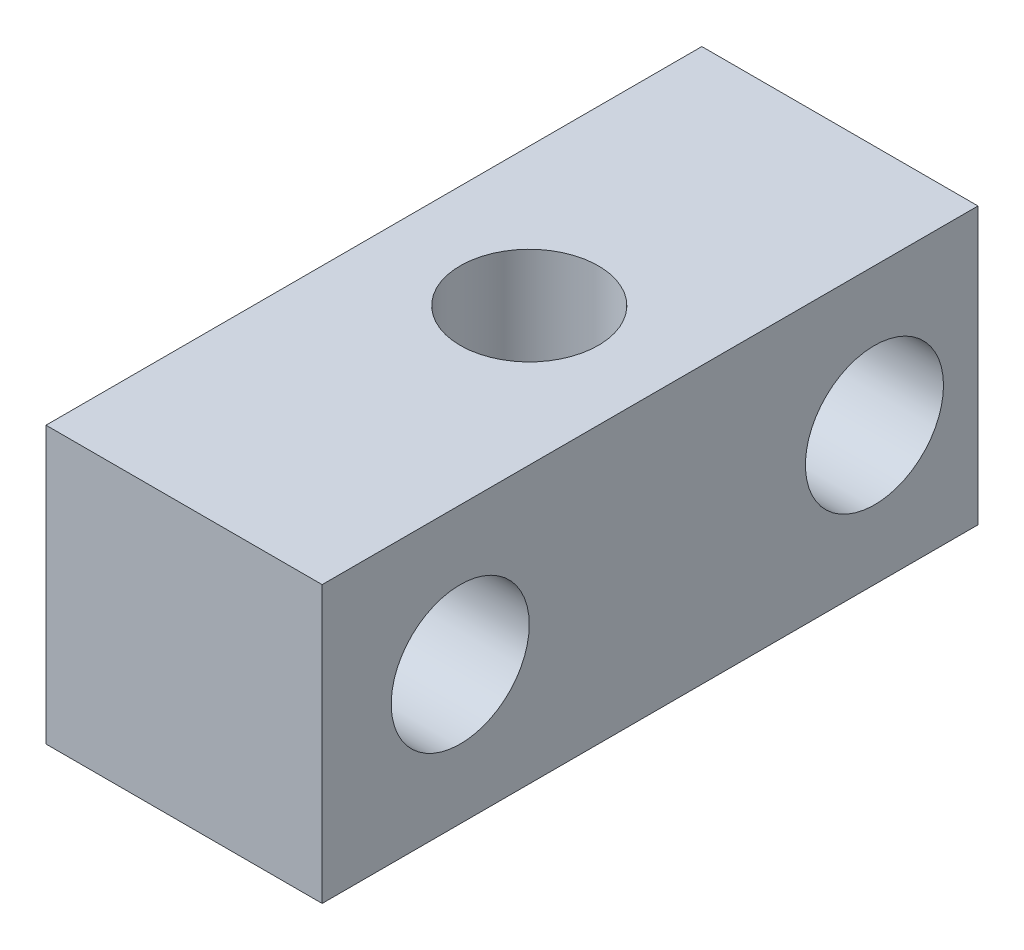
ISO-10303-21;
HEADER;
FILE_DESCRIPTION(('STEP AP214'),'2;1');
FILE_NAME('part.step','',(''),(''),'','','');
FILE_SCHEMA(('AUTOMOTIVE_DESIGN { 1 0 10303 214 1 1 1 1 }'));
ENDSEC;
DATA;
#1=APPLICATION_CONTEXT('core data for automotive mechanical design processes');
#2=APPLICATION_PROTOCOL_DEFINITION('international standard','automotive_design',2000,#1);
#3=PRODUCT_CONTEXT('',#1,'mechanical');
#4=PRODUCT('Part','Part','',(#3));
#5=PRODUCT_RELATED_PRODUCT_CATEGORY('part','',(#4));
#6=PRODUCT_DEFINITION_FORMATION('','',#4);
#7=PRODUCT_DEFINITION_CONTEXT('part definition',#1,'design');
#8=PRODUCT_DEFINITION('design','',#6,#7);
#9=PRODUCT_DEFINITION_SHAPE('','',#8);
#10=(LENGTH_UNIT() NAMED_UNIT(*) SI_UNIT(.MILLI.,.METRE.));
#11=(NAMED_UNIT(*) PLANE_ANGLE_UNIT() SI_UNIT($,.RADIAN.));
#12=(NAMED_UNIT(*) SI_UNIT($,.STERADIAN.) SOLID_ANGLE_UNIT());
#13=UNCERTAINTY_MEASURE_WITH_UNIT(LENGTH_MEASURE(1.E-05),#10,'distance_accuracy_value','');
#14=(GEOMETRIC_REPRESENTATION_CONTEXT(3) GLOBAL_UNCERTAINTY_ASSIGNED_CONTEXT((#13)) GLOBAL_UNIT_ASSIGNED_CONTEXT((#10,
#11,#12)) REPRESENTATION_CONTEXT('',''));
#15=CARTESIAN_POINT('',(0.,0.,0.));
#16=DIRECTION('',(0.,0.,1.));
#17=DIRECTION('',(1.,0.,0.));
#18=AXIS2_PLACEMENT_3D('',#15,#16,#17);
#19=CARTESIAN_POINT('',(-6.35,6.35,34.925));
#20=DIRECTION('',(0.,-1.,0.));
#21=DIRECTION('',(0.,0.,-1.));
#22=AXIS2_PLACEMENT_3D('',#19,#20,#21);
#23=PLANE('',#22);
#24=DIRECTION('',(0.,0.,-1.));
#25=VECTOR('',#24,1.);
#26=CARTESIAN_POINT('',(6.35,6.35,34.925));
#27=LINE('',#26,#25);
#28=CARTESIAN_POINT('',(6.35,6.35,34.925));
#29=VERTEX_POINT('',#28);
#30=CARTESIAN_POINT('',(6.35,6.35,4.7625));
#31=VERTEX_POINT('',#30);
#32=EDGE_CURVE('E104',#29,#31,#27,.T.);
#33=ORIENTED_EDGE('',*,*,#32,.T.);
#34=DIRECTION('',(1.,0.,0.));
#35=VECTOR('',#34,1.);
#36=CARTESIAN_POINT('',(0.,6.35,4.7625));
#37=LINE('',#36,#35);
#38=CARTESIAN_POINT('',(-6.35,6.35,4.7625));
#39=VERTEX_POINT('',#38);
#40=EDGE_CURVE('E47',#39,#31,#37,.T.);
#41=ORIENTED_EDGE('',*,*,#40,.F.);
#42=DIRECTION('',(0.,0.,-1.));
#43=VECTOR('',#42,1.);
#44=CARTESIAN_POINT('',(-6.35,6.35,34.925));
#45=LINE('',#44,#43);
#46=CARTESIAN_POINT('',(-6.35,6.35,34.925));
#47=VERTEX_POINT('',#46);
#48=EDGE_CURVE('E85',#47,#39,#45,.T.);
#49=ORIENTED_EDGE('',*,*,#48,.F.);
#50=DIRECTION('',(-1.,0.,0.));
#51=VECTOR('',#50,1.);
#52=CARTESIAN_POINT('',(-6.35,6.35,34.925));
#53=LINE('',#52,#51);
#54=EDGE_CURVE('E55',#29,#47,#53,.T.);
#55=ORIENTED_EDGE('',*,*,#54,.F.);
#56=EDGE_LOOP('',(#33,#41,#49,#55));
#57=FACE_BOUND('',#56,.T.);
#58=CARTESIAN_POINT('',(0.,6.35,19.05));
#59=DIRECTION('',(0.,1.,0.));
#60=DIRECTION('',(0.,0.,1.));
#61=AXIS2_PLACEMENT_3D('',#58,#59,#60);
#62=CIRCLE('',#61,3.17499999999999);
#63=CARTESIAN_POINT('',(0.,6.35,22.225));
#64=VERTEX_POINT('',#63);
#65=EDGE_CURVE('E97',#64,#64,#62,.T.);
#66=ORIENTED_EDGE('',*,*,#65,.F.);
#67=EDGE_LOOP('',(#66));
#68=FACE_BOUND('',#67,.T.);
#69=ADVANCED_FACE('F32',(#57,#68),#23,.F.);
#70=CARTESIAN_POINT('',(-6.35,-6.35,34.925));
#71=DIRECTION('',(1.,0.,0.));
#72=DIRECTION('',(0.,0.,-1.));
#73=AXIS2_PLACEMENT_3D('',#70,#71,#72);
#74=PLANE('',#73);
#75=CARTESIAN_POINT('',(-6.35,0.,9.525));
#76=DIRECTION('',(1.,0.,0.));
#77=DIRECTION('',(0.,0.,-1.));
#78=AXIS2_PLACEMENT_3D('',#75,#76,#77);
#79=CIRCLE('',#78,3.175);
#80=CARTESIAN_POINT('',(-6.35,0.,6.35000000000001));
#81=VERTEX_POINT('',#80);
#82=EDGE_CURVE('E117',#81,#81,#79,.T.);
#83=ORIENTED_EDGE('',*,*,#82,.T.);
#84=EDGE_LOOP('',(#83));
#85=FACE_BOUND('',#84,.T.);
#86=CARTESIAN_POINT('',(-6.35,0.,28.575));
#87=DIRECTION('',(1.,0.,0.));
#88=DIRECTION('',(0.,0.,-1.));
#89=AXIS2_PLACEMENT_3D('',#86,#87,#88);
#90=CIRCLE('',#89,3.175);
#91=CARTESIAN_POINT('',(-6.35,0.,25.4));
#92=VERTEX_POINT('',#91);
#93=EDGE_CURVE('E123',#92,#92,#90,.T.);
#94=ORIENTED_EDGE('',*,*,#93,.T.);
#95=EDGE_LOOP('',(#94));
#96=FACE_BOUND('',#95,.T.);
#97=ORIENTED_EDGE('',*,*,#48,.T.);
#98=DIRECTION('',(0.,1.,0.));
#99=VECTOR('',#98,1.);
#100=CARTESIAN_POINT('',(-6.35,-6.35,4.7625));
#101=LINE('',#100,#99);
#102=CARTESIAN_POINT('',(-6.35,-6.35,4.7625));
#103=VERTEX_POINT('',#102);
#104=EDGE_CURVE('E75',#103,#39,#101,.T.);
#105=ORIENTED_EDGE('',*,*,#104,.F.);
#106=DIRECTION('',(0.,0.,-1.));
#107=VECTOR('',#106,1.);
#108=CARTESIAN_POINT('',(-6.35,-6.35,34.925));
#109=LINE('',#108,#107);
#110=CARTESIAN_POINT('',(-6.35,-6.35,34.925));
#111=VERTEX_POINT('',#110);
#112=EDGE_CURVE('E11',#111,#103,#109,.T.);
#113=ORIENTED_EDGE('',*,*,#112,.F.);
#114=DIRECTION('',(0.,-1.,0.));
#115=VECTOR('',#114,1.);
#116=CARTESIAN_POINT('',(-6.35,-6.35,34.925));
#117=LINE('',#116,#115);
#118=EDGE_CURVE('E91',#47,#111,#117,.T.);
#119=ORIENTED_EDGE('',*,*,#118,.F.);
#120=EDGE_LOOP('',(#97,#105,#113,#119));
#121=FACE_BOUND('',#120,.T.);
#122=ADVANCED_FACE('F34',(#85,#96,#121),#74,.F.);
#123=CARTESIAN_POINT('',(-6.35,-6.35,34.925));
#124=DIRECTION('',(0.,1.,0.));
#125=DIRECTION('',(0.,0.,1.));
#126=AXIS2_PLACEMENT_3D('',#123,#124,#125);
#127=PLANE('',#126);
#128=CARTESIAN_POINT('',(0.,-6.35,19.05));
#129=DIRECTION('',(0.,1.,0.));
#130=DIRECTION('',(0.,0.,1.));
#131=AXIS2_PLACEMENT_3D('',#128,#129,#130);
#132=CIRCLE('',#131,3.175);
#133=CARTESIAN_POINT('',(0.,-6.35,22.225));
#134=VERTEX_POINT('',#133);
#135=EDGE_CURVE('E94',#134,#134,#132,.T.);
#136=ORIENTED_EDGE('',*,*,#135,.T.);
#137=EDGE_LOOP('',(#136));
#138=FACE_BOUND('',#137,.T.);
#139=ORIENTED_EDGE('',*,*,#112,.T.);
#140=DIRECTION('',(1.,0.,0.));
#141=VECTOR('',#140,1.);
#142=CARTESIAN_POINT('',(0.,-6.35,4.7625));
#143=LINE('',#142,#141);
#144=CARTESIAN_POINT('',(6.35,-6.35,4.7625));
#145=VERTEX_POINT('',#144);
#146=EDGE_CURVE('E72',#103,#145,#143,.T.);
#147=ORIENTED_EDGE('',*,*,#146,.T.);
#148=DIRECTION('',(0.,0.,-1.));
#149=VECTOR('',#148,1.);
#150=CARTESIAN_POINT('',(6.35,-6.35,34.925));
#151=LINE('',#150,#149);
#152=CARTESIAN_POINT('',(6.35,-6.35,34.925));
#153=VERTEX_POINT('',#152);
#154=EDGE_CURVE('E40',#153,#145,#151,.T.);
#155=ORIENTED_EDGE('',*,*,#154,.F.);
#156=DIRECTION('',(1.,0.,0.));
#157=VECTOR('',#156,1.);
#158=CARTESIAN_POINT('',(-6.35,-6.35,34.925));
#159=LINE('',#158,#157);
#160=EDGE_CURVE('E88',#111,#153,#159,.T.);
#161=ORIENTED_EDGE('',*,*,#160,.F.);
#162=EDGE_LOOP('',(#139,#147,#155,#161));
#163=FACE_BOUND('',#162,.T.);
#164=ADVANCED_FACE('F87',(#138,#163),#127,.F.);
#165=CARTESIAN_POINT('',(6.35,-6.35,34.925));
#166=DIRECTION('',(-1.,0.,0.));
#167=DIRECTION('',(0.,0.,1.));
#168=AXIS2_PLACEMENT_3D('',#165,#166,#167);
#169=PLANE('',#168);
#170=CARTESIAN_POINT('',(6.35,0.,9.525));
#171=DIRECTION('',(1.,0.,0.));
#172=DIRECTION('',(0.,0.,-1.));
#173=AXIS2_PLACEMENT_3D('',#170,#171,#172);
#174=CIRCLE('',#173,3.17499999999999);
#175=CARTESIAN_POINT('',(6.35,0.,6.35000000000002));
#176=VERTEX_POINT('',#175);
#177=EDGE_CURVE('E113',#176,#176,#174,.T.);
#178=ORIENTED_EDGE('',*,*,#177,.F.);
#179=EDGE_LOOP('',(#178));
#180=FACE_BOUND('',#179,.T.);
#181=CARTESIAN_POINT('',(6.35,0.,28.575));
#182=DIRECTION('',(1.,0.,0.));
#183=DIRECTION('',(0.,0.,-1.));
#184=AXIS2_PLACEMENT_3D('',#181,#182,#183);
#185=CIRCLE('',#184,3.17499999999999);
#186=CARTESIAN_POINT('',(6.35,0.,25.4));
#187=VERTEX_POINT('',#186);
#188=EDGE_CURVE('E120',#187,#187,#185,.T.);
#189=ORIENTED_EDGE('',*,*,#188,.F.);
#190=EDGE_LOOP('',(#189));
#191=FACE_BOUND('',#190,.T.);
#192=ORIENTED_EDGE('',*,*,#154,.T.);
#193=DIRECTION('',(0.,1.,0.));
#194=VECTOR('',#193,1.);
#195=CARTESIAN_POINT('',(6.35,-6.35,4.7625));
#196=LINE('',#195,#194);
#197=EDGE_CURVE('E76',#145,#31,#196,.T.);
#198=ORIENTED_EDGE('',*,*,#197,.T.);
#199=ORIENTED_EDGE('',*,*,#32,.F.);
#200=DIRECTION('',(0.,1.,0.));
#201=VECTOR('',#200,1.);
#202=CARTESIAN_POINT('',(6.35,-6.35,34.925));
#203=LINE('',#202,#201);
#204=EDGE_CURVE('E90',#153,#29,#203,.T.);
#205=ORIENTED_EDGE('',*,*,#204,.F.);
#206=EDGE_LOOP('',(#192,#198,#199,#205));
#207=FACE_BOUND('',#206,.T.);
#208=ADVANCED_FACE('F107',(#180,#191,#207),#169,.F.);
#209=CARTESIAN_POINT('',(0.,0.,34.925));
#210=DIRECTION('',(0.,0.,-1.));
#211=DIRECTION('',(-1.,0.,0.));
#212=AXIS2_PLACEMENT_3D('',#209,#210,#211);
#213=PLANE('',#212);
#214=ORIENTED_EDGE('',*,*,#118,.T.);
#215=ORIENTED_EDGE('',*,*,#160,.T.);
#216=ORIENTED_EDGE('',*,*,#204,.T.);
#217=ORIENTED_EDGE('',*,*,#54,.T.);
#218=EDGE_LOOP('',(#214,#215,#216,#217));
#219=FACE_BOUND('',#218,.T.);
#220=ADVANCED_FACE('F93',(#219),#213,.F.);
#221=CARTESIAN_POINT('',(0.,6.35,19.05));
#222=DIRECTION('',(0.,1.,0.));
#223=DIRECTION('',(0.,0.,1.));
#224=AXIS2_PLACEMENT_3D('',#221,#222,#223);
#225=CYLINDRICAL_SURFACE('',#224,3.17499999999999);
#226=ORIENTED_EDGE('',*,*,#135,.F.);
#227=EDGE_LOOP('',(#226));
#228=FACE_BOUND('',#227,.T.);
#229=ORIENTED_EDGE('',*,*,#65,.T.);
#230=EDGE_LOOP('',(#229));
#231=FACE_BOUND('',#230,.T.);
#232=ADVANCED_FACE('F128',(#228,#231),#225,.F.);
#233=CARTESIAN_POINT('',(6.35,0.,28.575));
#234=DIRECTION('',(1.,0.,0.));
#235=DIRECTION('',(0.,0.,-1.));
#236=AXIS2_PLACEMENT_3D('',#233,#234,#235);
#237=CYLINDRICAL_SURFACE('',#236,3.17499999999999);
#238=ORIENTED_EDGE('',*,*,#93,.F.);
#239=EDGE_LOOP('',(#238));
#240=FACE_BOUND('',#239,.T.);
#241=ORIENTED_EDGE('',*,*,#188,.T.);
#242=EDGE_LOOP('',(#241));
#243=FACE_BOUND('',#242,.T.);
#244=ADVANCED_FACE('F147',(#240,#243),#237,.F.);
#245=CARTESIAN_POINT('',(6.35,0.,9.525));
#246=DIRECTION('',(1.,0.,0.));
#247=DIRECTION('',(0.,0.,-1.));
#248=AXIS2_PLACEMENT_3D('',#245,#246,#247);
#249=CYLINDRICAL_SURFACE('',#248,3.17499999999999);
#250=ORIENTED_EDGE('',*,*,#82,.F.);
#251=EDGE_LOOP('',(#250));
#252=FACE_BOUND('',#251,.T.);
#253=ORIENTED_EDGE('',*,*,#177,.T.);
#254=EDGE_LOOP('',(#253));
#255=FACE_BOUND('',#254,.T.);
#256=ADVANCED_FACE('F152',(#252,#255),#249,.F.);
#257=CARTESIAN_POINT('',(0.,-6.35,4.7625));
#258=DIRECTION('',(0.,0.,1.));
#259=DIRECTION('',(1.,0.,0.));
#260=AXIS2_PLACEMENT_3D('',#257,#258,#259);
#261=PLANE('',#260);
#262=ORIENTED_EDGE('',*,*,#40,.T.);
#263=ORIENTED_EDGE('',*,*,#197,.F.);
#264=ORIENTED_EDGE('',*,*,#146,.F.);
#265=ORIENTED_EDGE('',*,*,#104,.T.);
#266=EDGE_LOOP('',(#262,#263,#264,#265));
#267=FACE_BOUND('',#266,.T.);
#268=ADVANCED_FACE('F74',(#267),#261,.F.);
#269=CLOSED_SHELL('',(#69,#122,#164,#208,#220,#232,#244,#256,#268));
#270=MANIFOLD_SOLID_BREP('B2',#269);
#271=ADVANCED_BREP_SHAPE_REPRESENTATION('',(#18,#270),#14);
#272=SHAPE_DEFINITION_REPRESENTATION(#9,#271);
ENDSEC;
END-ISO-10303-21;
